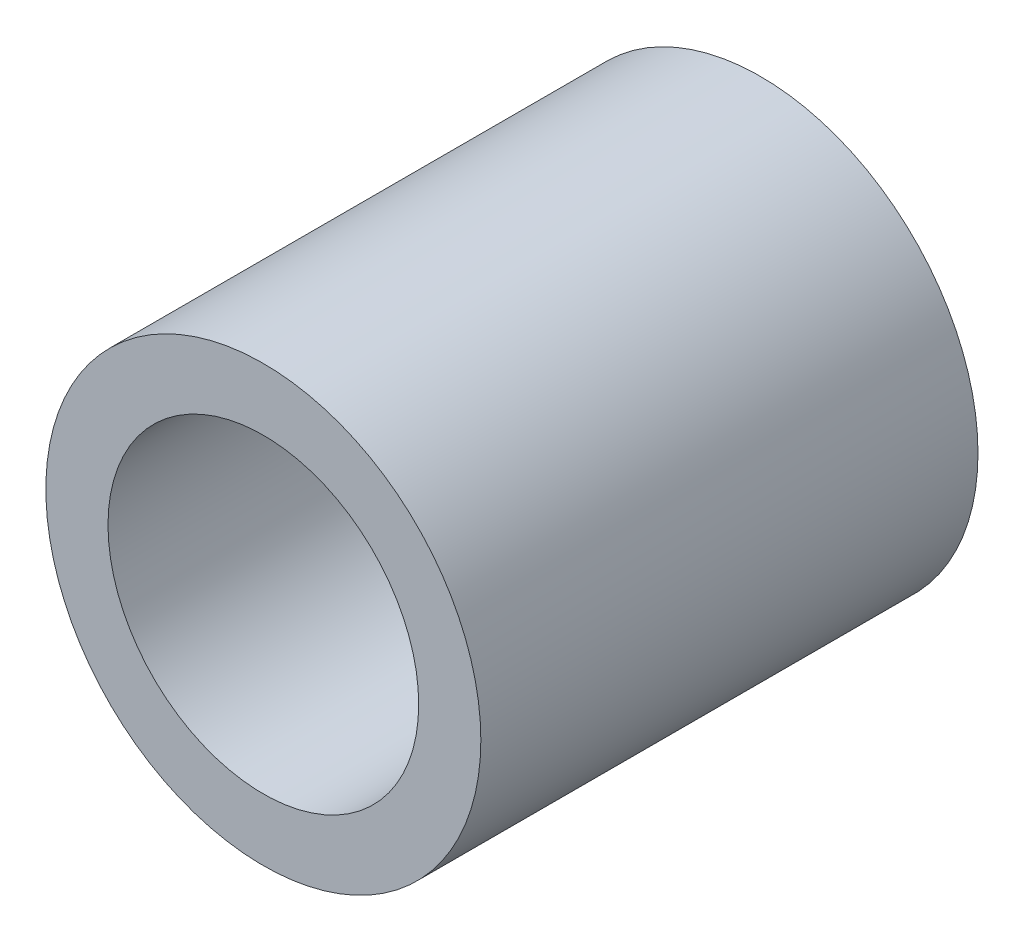
ISO-10303-21;
HEADER;
FILE_DESCRIPTION(('STEP AP214'),'2;1');
FILE_NAME('part.step','',(''),(''),'','','');
FILE_SCHEMA(('AUTOMOTIVE_DESIGN { 1 0 10303 214 1 1 1 1 }'));
ENDSEC;
DATA;
#1=APPLICATION_CONTEXT('core data for automotive mechanical design processes');
#2=APPLICATION_PROTOCOL_DEFINITION('international standard','automotive_design',2000,#1);
#3=PRODUCT_CONTEXT('',#1,'mechanical');
#4=PRODUCT('Part','Part','',(#3));
#5=PRODUCT_RELATED_PRODUCT_CATEGORY('part','',(#4));
#6=PRODUCT_DEFINITION_FORMATION('','',#4);
#7=PRODUCT_DEFINITION_CONTEXT('part definition',#1,'design');
#8=PRODUCT_DEFINITION('design','',#6,#7);
#9=PRODUCT_DEFINITION_SHAPE('','',#8);
#10=(LENGTH_UNIT() NAMED_UNIT(*) SI_UNIT(.MILLI.,.METRE.));
#11=(NAMED_UNIT(*) PLANE_ANGLE_UNIT() SI_UNIT($,.RADIAN.));
#12=(NAMED_UNIT(*) SI_UNIT($,.STERADIAN.) SOLID_ANGLE_UNIT());
#13=UNCERTAINTY_MEASURE_WITH_UNIT(LENGTH_MEASURE(1.E-05),#10,'distance_accuracy_value','');
#14=(GEOMETRIC_REPRESENTATION_CONTEXT(3) GLOBAL_UNCERTAINTY_ASSIGNED_CONTEXT((#13)) GLOBAL_UNIT_ASSIGNED_CONTEXT((#10,
#11,#12)) REPRESENTATION_CONTEXT('',''));
#15=CARTESIAN_POINT('',(0.,0.,0.));
#16=DIRECTION('',(0.,0.,1.));
#17=DIRECTION('',(1.,0.,0.));
#18=AXIS2_PLACEMENT_3D('',#15,#16,#17);
#19=CARTESIAN_POINT('',(0.,0.,8.));
#20=DIRECTION('',(0.,0.,1.));
#21=DIRECTION('',(1.,0.,0.));
#22=AXIS2_PLACEMENT_3D('',#19,#20,#21);
#23=PLANE('',#22);
#24=CARTESIAN_POINT('',(0.,0.,8.));
#25=DIRECTION('',(0.,0.,1.));
#26=DIRECTION('',(1.,0.,0.));
#27=AXIS2_PLACEMENT_3D('',#24,#25,#26);
#28=CIRCLE('',#27,3.5);
#29=CARTESIAN_POINT('',(3.5,0.,8.));
#30=VERTEX_POINT('',#29);
#31=EDGE_CURVE('E10',#30,#30,#28,.T.);
#32=ORIENTED_EDGE('',*,*,#31,.T.);
#33=EDGE_LOOP('',(#32));
#34=FACE_BOUND('',#33,.T.);
#35=CARTESIAN_POINT('',(0.,0.,8.));
#36=DIRECTION('',(0.,0.,1.));
#37=DIRECTION('',(1.,0.,0.));
#38=AXIS2_PLACEMENT_3D('',#35,#36,#37);
#39=CIRCLE('',#38,2.5);
#40=CARTESIAN_POINT('',(2.5,0.,8.));
#41=VERTEX_POINT('',#40);
#42=EDGE_CURVE('E53',#41,#41,#39,.T.);
#43=ORIENTED_EDGE('',*,*,#42,.F.);
#44=EDGE_LOOP('',(#43));
#45=FACE_BOUND('',#44,.T.);
#46=ADVANCED_FACE('F40',(#34,#45),#23,.T.);
#47=CARTESIAN_POINT('',(0.,0.,0.));
#48=DIRECTION('',(0.,0.,1.));
#49=DIRECTION('',(1.,0.,0.));
#50=AXIS2_PLACEMENT_3D('',#47,#48,#49);
#51=PLANE('',#50);
#52=CARTESIAN_POINT('',(0.,0.,0.));
#53=DIRECTION('',(0.,0.,1.));
#54=DIRECTION('',(1.,0.,0.));
#55=AXIS2_PLACEMENT_3D('',#52,#53,#54);
#56=CIRCLE('',#55,3.5);
#57=CARTESIAN_POINT('',(3.5,0.,0.));
#58=VERTEX_POINT('',#57);
#59=EDGE_CURVE('E44',#58,#58,#56,.T.);
#60=ORIENTED_EDGE('',*,*,#59,.F.);
#61=EDGE_LOOP('',(#60));
#62=FACE_BOUND('',#61,.T.);
#63=CARTESIAN_POINT('',(0.,0.,0.));
#64=DIRECTION('',(0.,0.,1.));
#65=DIRECTION('',(1.,0.,0.));
#66=AXIS2_PLACEMENT_3D('',#63,#64,#65);
#67=CIRCLE('',#66,2.5);
#68=CARTESIAN_POINT('',(2.5,0.,0.));
#69=VERTEX_POINT('',#68);
#70=EDGE_CURVE('E55',#69,#69,#67,.T.);
#71=ORIENTED_EDGE('',*,*,#70,.T.);
#72=EDGE_LOOP('',(#71));
#73=FACE_BOUND('',#72,.T.);
#74=ADVANCED_FACE('F67',(#62,#73),#51,.F.);
#75=CARTESIAN_POINT('',(0.,0.,8.));
#76=DIRECTION('',(0.,0.,-1.));
#77=DIRECTION('',(-1.,0.,0.));
#78=AXIS2_PLACEMENT_3D('',#75,#76,#77);
#79=CYLINDRICAL_SURFACE('',#78,3.5);
#80=ORIENTED_EDGE('',*,*,#31,.F.);
#81=EDGE_LOOP('',(#80));
#82=FACE_BOUND('',#81,.T.);
#83=ORIENTED_EDGE('',*,*,#59,.T.);
#84=EDGE_LOOP('',(#83));
#85=FACE_BOUND('',#84,.T.);
#86=ADVANCED_FACE('F42',(#82,#85),#79,.T.);
#87=CARTESIAN_POINT('',(0.,0.,8.));
#88=DIRECTION('',(0.,0.,-1.));
#89=DIRECTION('',(-1.,0.,0.));
#90=AXIS2_PLACEMENT_3D('',#87,#88,#89);
#91=CYLINDRICAL_SURFACE('',#90,2.5);
#92=ORIENTED_EDGE('',*,*,#42,.T.);
#93=EDGE_LOOP('',(#92));
#94=FACE_BOUND('',#93,.T.);
#95=ORIENTED_EDGE('',*,*,#70,.F.);
#96=EDGE_LOOP('',(#95));
#97=FACE_BOUND('',#96,.T.);
#98=ADVANCED_FACE('F63',(#94,#97),#91,.F.);
#99=CLOSED_SHELL('',(#46,#74,#86,#98));
#100=MANIFOLD_SOLID_BREP('B2',#99);
#101=ADVANCED_BREP_SHAPE_REPRESENTATION('',(#18,#100),#14);
#102=SHAPE_DEFINITION_REPRESENTATION(#9,#101);
ENDSEC;
END-ISO-10303-21;
